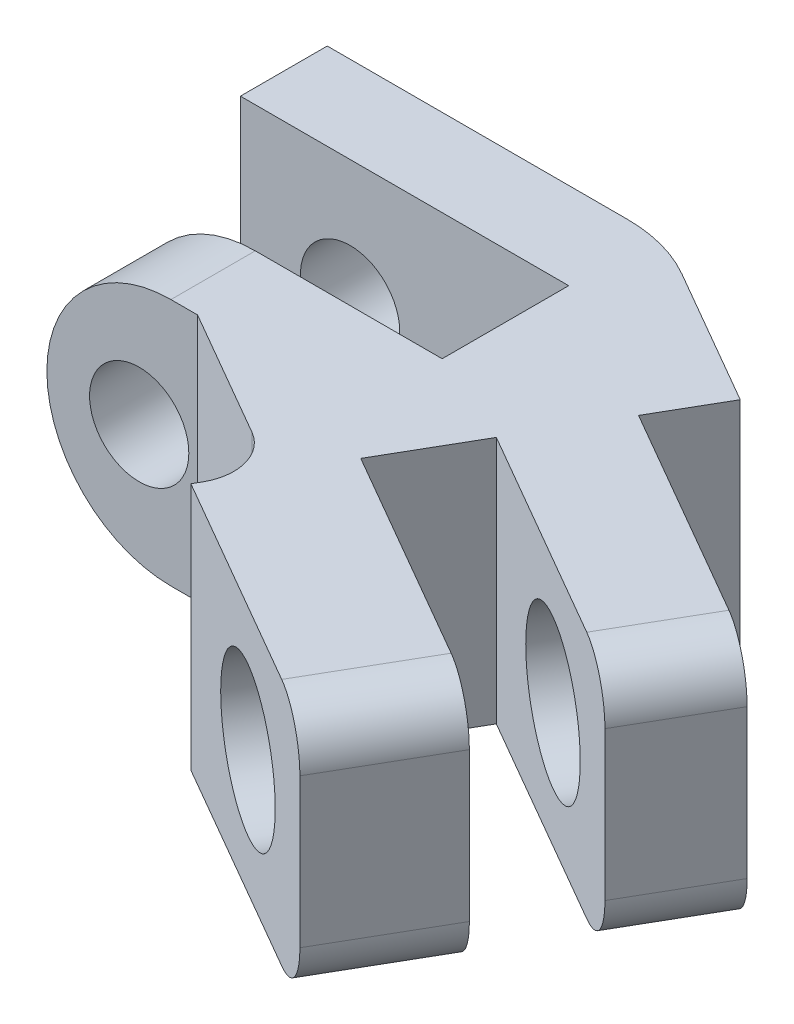
ISO-10303-21;
HEADER;
FILE_DESCRIPTION(('STEP AP214'),'2;1');
FILE_NAME('part.step','',(''),(''),'','','');
FILE_SCHEMA(('AUTOMOTIVE_DESIGN { 1 0 10303 214 1 1 1 1 }'));
ENDSEC;
DATA;
#1=APPLICATION_CONTEXT('core data for automotive mechanical design processes');
#2=APPLICATION_PROTOCOL_DEFINITION('international standard','automotive_design',2000,#1);
#3=PRODUCT_CONTEXT('',#1,'mechanical');
#4=PRODUCT('Part','Part','',(#3));
#5=PRODUCT_RELATED_PRODUCT_CATEGORY('part','',(#4));
#6=PRODUCT_DEFINITION_FORMATION('','',#4);
#7=PRODUCT_DEFINITION_CONTEXT('part definition',#1,'design');
#8=PRODUCT_DEFINITION('design','',#6,#7);
#9=PRODUCT_DEFINITION_SHAPE('','',#8);
#10=(LENGTH_UNIT() NAMED_UNIT(*) SI_UNIT(.MILLI.,.METRE.));
#11=(NAMED_UNIT(*) PLANE_ANGLE_UNIT() SI_UNIT($,.RADIAN.));
#12=(NAMED_UNIT(*) SI_UNIT($,.STERADIAN.) SOLID_ANGLE_UNIT());
#13=UNCERTAINTY_MEASURE_WITH_UNIT(LENGTH_MEASURE(1.E-05),#10,'distance_accuracy_value','');
#14=(GEOMETRIC_REPRESENTATION_CONTEXT(3) GLOBAL_UNCERTAINTY_ASSIGNED_CONTEXT((#13)) GLOBAL_UNIT_ASSIGNED_CONTEXT((#10,
#11,#12)) REPRESENTATION_CONTEXT('',''));
#15=CARTESIAN_POINT('',(0.,0.,0.));
#16=DIRECTION('',(0.,0.,1.));
#17=DIRECTION('',(1.,0.,0.));
#18=AXIS2_PLACEMENT_3D('',#15,#16,#17);
#19=CARTESIAN_POINT('',(7.86121593216771,-2.5,13.3121778264911));
#20=DIRECTION('',(-0.866025403784438,0.,-0.500000000000001));
#21=DIRECTION('',(-0.500000000000001,0.,0.866025403784438));
#22=AXIS2_PLACEMENT_3D('',#19,#20,#21);
#23=PLANE('',#22);
#24=DIRECTION('',(0.,-1.,0.));
#25=VECTOR('',#24,1.);
#26=CARTESIAN_POINT('',(11.9102540378444,1.5,6.29903810567667));
#27=LINE('',#26,#25);
#28=CARTESIAN_POINT('',(11.9102540378444,1.5,6.29903810567667));
#29=VERTEX_POINT('',#28);
#30=CARTESIAN_POINT('',(11.9102540378444,-1.5,6.29903810567667));
#31=VERTEX_POINT('',#30);
#32=EDGE_CURVE('E49',#29,#31,#27,.T.);
#33=ORIENTED_EDGE('',*,*,#32,.F.);
#34=DIRECTION('',(0.500000000000001,0.,-0.866025403784438));
#35=VECTOR('',#34,1.);
#36=CARTESIAN_POINT('',(10.8612159321677,1.5,8.11602540378445));
#37=LINE('',#36,#35);
#38=CARTESIAN_POINT('',(10.8612159321677,1.5,8.11602540378445));
#39=VERTEX_POINT('',#38);
#40=EDGE_CURVE('E232',#29,#39,#37,.F.);
#41=ORIENTED_EDGE('',*,*,#40,.T.);
#42=DIRECTION('',(0.,1.,0.));
#43=VECTOR('',#42,1.);
#44=CARTESIAN_POINT('',(10.8612159321677,-2.5,8.11602540378445));
#45=LINE('',#44,#43);
#46=CARTESIAN_POINT('',(10.8612159321677,-1.5,8.11602540378445));
#47=VERTEX_POINT('',#46);
#48=EDGE_CURVE('E243',#47,#39,#45,.T.);
#49=ORIENTED_EDGE('',*,*,#48,.F.);
#50=DIRECTION('',(0.500000000000001,0.,-0.866025403784438));
#51=VECTOR('',#50,1.);
#52=CARTESIAN_POINT('',(12.6602540378444,-1.5,5.00000000000001));
#53=LINE('',#52,#51);
#54=EDGE_CURVE('E230',#47,#31,#53,.T.);
#55=ORIENTED_EDGE('',*,*,#54,.T.);
#56=EDGE_LOOP('',(#33,#41,#49,#55));
#57=FACE_BOUND('',#56,.T.);
#58=ADVANCED_FACE('F34',(#57),#23,.F.);
#59=CARTESIAN_POINT('',(2.79544915328567,0.,16.3695068206205));
#60=DIRECTION('',(0.500000000000001,0.,-0.866025403784438));
#61=DIRECTION('',(-0.866025403784438,0.,-0.500000000000001));
#62=AXIS2_PLACEMENT_3D('',#59,#60,#61);
#63=CYLINDRICAL_SURFACE('',#62,1.5);
#64=CARTESIAN_POINT('',(8.38575313632761,0.,6.68681629223726));
#65=DIRECTION('',(-0.500000000000001,0.,0.866025403784438));
#66=DIRECTION('',(0.866025403784438,0.,0.500000000000001));
#67=AXIS2_PLACEMENT_3D('',#64,#65,#66);
#68=CIRCLE('',#67,1.5);
#69=CARTESIAN_POINT('',(9.68479124200427,0.,7.43681629223726));
#70=VERTEX_POINT('',#69);
#71=EDGE_CURVE('E294',#70,#70,#68,.T.);
#72=ORIENTED_EDGE('',*,*,#71,.T.);
#73=EDGE_LOOP('',(#72));
#74=FACE_BOUND('',#73,.T.);
#75=CARTESIAN_POINT('',(9.43479124200427,0.,4.86982899412947));
#76=DIRECTION('',(0.500000000000001,0.,-0.866025403784438));
#77=DIRECTION('',(-0.866025403784438,0.,-0.500000000000001));
#78=AXIS2_PLACEMENT_3D('',#75,#76,#77);
#79=CIRCLE('',#78,1.5);
#80=CARTESIAN_POINT('',(8.13575313632762,0.,4.11982899412947));
#81=VERTEX_POINT('',#80);
#82=EDGE_CURVE('E268',#81,#81,#79,.F.);
#83=ORIENTED_EDGE('',*,*,#82,.F.);
#84=EDGE_LOOP('',(#83));
#85=FACE_BOUND('',#84,.T.);
#86=ADVANCED_FACE('F450',(#74,#85),#63,.F.);
#87=CARTESIAN_POINT('',(5.42351829610426,1.5,15.5343939856435));
#88=DIRECTION('',(-0.500000000000001,0.,0.866025403784438));
#89=DIRECTION('',(0.866025403784438,0.,0.500000000000001));
#90=AXIS2_PLACEMENT_3D('',#87,#88,#89);
#91=CYLINDRICAL_SURFACE('',#90,1.);
#92=ORIENTED_EDGE('',*,*,#40,.F.);
#93=CARTESIAN_POINT('',(11.0442286340599,1.5,5.79903810567667));
#94=DIRECTION('',(0.500000000000001,0.,-0.866025403784438));
#95=DIRECTION('',(-0.866025403784438,0.,-0.500000000000001));
#96=AXIS2_PLACEMENT_3D('',#93,#94,#95);
#97=CIRCLE('',#96,1.);
#98=CARTESIAN_POINT('',(11.0442286340599,2.5,5.79903810567667));
#99=VERTEX_POINT('',#98);
#100=EDGE_CURVE('E258',#99,#29,#97,.T.);
#101=ORIENTED_EDGE('',*,*,#100,.F.);
#102=DIRECTION('',(0.500000000000001,0.,-0.866025403784438));
#103=VECTOR('',#102,1.);
#104=CARTESIAN_POINT('',(11.7942286340599,2.5,4.50000000000001));
#105=LINE('',#104,#103);
#106=CARTESIAN_POINT('',(9.99519052838328,2.5,7.61602540378445));
#107=VERTEX_POINT('',#106);
#108=EDGE_CURVE('E220',#107,#99,#105,.T.);
#109=ORIENTED_EDGE('',*,*,#108,.F.);
#110=CARTESIAN_POINT('',(9.99519052838328,1.5,7.61602540378445));
#111=DIRECTION('',(-0.500000000000001,0.,0.866025403784438));
#112=DIRECTION('',(0.866025403784438,0.,0.500000000000001));
#113=AXIS2_PLACEMENT_3D('',#110,#111,#112);
#114=CIRCLE('',#113,1.);
#115=EDGE_CURVE('E42',#39,#107,#114,.T.);
#116=ORIENTED_EDGE('',*,*,#115,.F.);
#117=EDGE_LOOP('',(#92,#101,#109,#116));
#118=FACE_BOUND('',#117,.T.);
#119=ADVANCED_FACE('F257',(#118),#91,.T.);
#120=CARTESIAN_POINT('',(6.99519052838327,-1.5,12.8121778264911));
#121=DIRECTION('',(-0.500000000000001,0.,0.866025403784438));
#122=DIRECTION('',(0.866025403784438,0.,0.500000000000001));
#123=AXIS2_PLACEMENT_3D('',#120,#121,#122);
#124=CYLINDRICAL_SURFACE('',#123,1.);
#125=DIRECTION('',(0.500000000000001,0.,-0.866025403784438));
#126=VECTOR('',#125,1.);
#127=CARTESIAN_POINT('',(9.99519052838328,-2.5,7.61602540378444));
#128=LINE('',#127,#126);
#129=CARTESIAN_POINT('',(11.0442286340599,-2.5,5.79903810567667));
#130=VERTEX_POINT('',#129);
#131=CARTESIAN_POINT('',(9.99519052838328,-2.5,7.61602540378445));
#132=VERTEX_POINT('',#131);
#133=EDGE_CURVE('E208',#130,#132,#128,.F.);
#134=ORIENTED_EDGE('',*,*,#133,.F.);
#135=CARTESIAN_POINT('',(11.0442286340599,-1.5,5.79903810567667));
#136=DIRECTION('',(0.500000000000001,0.,-0.866025403784438));
#137=DIRECTION('',(-0.866025403784438,0.,-0.500000000000001));
#138=AXIS2_PLACEMENT_3D('',#135,#136,#137);
#139=CIRCLE('',#138,0.999999999999999);
#140=EDGE_CURVE('E192',#31,#130,#139,.T.);
#141=ORIENTED_EDGE('',*,*,#140,.F.);
#142=ORIENTED_EDGE('',*,*,#54,.F.);
#143=CARTESIAN_POINT('',(9.99519052838328,-1.5,7.61602540378445));
#144=DIRECTION('',(-0.500000000000001,0.,0.866025403784438));
#145=DIRECTION('',(0.866025403784438,0.,0.500000000000001));
#146=AXIS2_PLACEMENT_3D('',#143,#144,#145);
#147=CIRCLE('',#146,1.);
#148=EDGE_CURVE('E215',#132,#47,#147,.T.);
#149=ORIENTED_EDGE('',*,*,#148,.F.);
#150=EDGE_LOOP('',(#134,#141,#142,#149));
#151=FACE_BOUND('',#150,.T.);
#152=ADVANCED_FACE('F36',(#151),#124,.T.);
#153=CARTESIAN_POINT('',(-0.639695783803518,0.,0.));
#154=DIRECTION('',(0.,0.,1.));
#155=DIRECTION('',(1.,0.,0.));
#156=AXIS2_PLACEMENT_3D('',#153,#154,#155);
#157=CYLINDRICAL_SURFACE('',#156,1.);
#158=CARTESIAN_POINT('',(-0.639695783803518,0.,0.));
#159=DIRECTION('',(0.,0.,1.));
#160=DIRECTION('',(1.,0.,0.));
#161=AXIS2_PLACEMENT_3D('',#158,#159,#160);
#162=CIRCLE('',#161,1.);
#163=CARTESIAN_POINT('',(0.360304216196482,0.,0.));
#164=VERTEX_POINT('',#163);
#165=EDGE_CURVE('E334',#164,#164,#162,.T.);
#166=ORIENTED_EDGE('',*,*,#165,.F.);
#167=EDGE_LOOP('',(#166));
#168=FACE_BOUND('',#167,.T.);
#169=CARTESIAN_POINT('',(-0.639695783803518,0.,1.75));
#170=DIRECTION('',(0.,0.,1.));
#171=DIRECTION('',(1.,0.,0.));
#172=AXIS2_PLACEMENT_3D('',#169,#170,#171);
#173=CIRCLE('',#172,1.);
#174=CARTESIAN_POINT('',(0.360304216196482,0.,1.75));
#175=VERTEX_POINT('',#174);
#176=EDGE_CURVE('E333',#175,#175,#173,.F.);
#177=ORIENTED_EDGE('',*,*,#176,.F.);
#178=EDGE_LOOP('',(#177));
#179=FACE_BOUND('',#178,.T.);
#180=ADVANCED_FACE('F480',(#168,#179),#157,.F.);
#181=CARTESIAN_POINT('',(0.,0.,6.));
#182=DIRECTION('',(0.,0.,1.));
#183=DIRECTION('',(1.,0.,0.));
#184=AXIS2_PLACEMENT_3D('',#181,#182,#183);
#185=PLANE('',#184);
#186=CARTESIAN_POINT('',(-0.639695783803518,0.,6.));
#187=DIRECTION('',(0.,0.,1.));
#188=DIRECTION('',(1.,0.,0.));
#189=AXIS2_PLACEMENT_3D('',#186,#187,#188);
#190=CIRCLE('',#189,1.);
#191=CARTESIAN_POINT('',(0.360304216196482,0.,6.));
#192=VERTEX_POINT('',#191);
#193=EDGE_CURVE('E338',#192,#192,#190,.T.);
#194=ORIENTED_EDGE('',*,*,#193,.F.);
#195=EDGE_LOOP('',(#194));
#196=FACE_BOUND('',#195,.T.);
#197=DIRECTION('',(-1.,0.,0.));
#198=VECTOR('',#197,1.);
#199=CARTESIAN_POINT('',(0.,-2.5,6.));
#200=LINE('',#199,#198);
#201=CARTESIAN_POINT('',(0.535898384862239,-2.5,6.));
#202=VERTEX_POINT('',#201);
#203=CARTESIAN_POINT('',(0.,-2.5,6.));
#204=VERTEX_POINT('',#203);
#205=EDGE_CURVE('E374',#202,#204,#200,.T.);
#206=ORIENTED_EDGE('',*,*,#205,.F.);
#207=DIRECTION('',(0.,1.,0.));
#208=VECTOR('',#207,1.);
#209=CARTESIAN_POINT('',(0.535898384862235,0.,6.));
#210=LINE('',#209,#208);
#211=CARTESIAN_POINT('',(0.535898384862239,2.5,6.));
#212=VERTEX_POINT('',#211);
#213=EDGE_CURVE('E363',#202,#212,#210,.T.);
#214=ORIENTED_EDGE('',*,*,#213,.T.);
#215=DIRECTION('',(1.,0.,0.));
#216=VECTOR('',#215,1.);
#217=CARTESIAN_POINT('',(0.,2.5,6.));
#218=LINE('',#217,#216);
#219=CARTESIAN_POINT('',(0.,2.5,6.));
#220=VERTEX_POINT('',#219);
#221=EDGE_CURVE('E369',#220,#212,#218,.T.);
#222=ORIENTED_EDGE('',*,*,#221,.F.);
#223=CARTESIAN_POINT('',(0.,0.,6.));
#224=DIRECTION('',(0.,0.,1.));
#225=DIRECTION('',(1.,0.,0.));
#226=AXIS2_PLACEMENT_3D('',#223,#224,#225);
#227=CIRCLE('',#226,2.5);
#228=EDGE_CURVE('E382',#220,#204,#227,.T.);
#229=ORIENTED_EDGE('',*,*,#228,.T.);
#230=EDGE_LOOP('',(#206,#214,#222,#229));
#231=FACE_BOUND('',#230,.T.);
#232=ADVANCED_FACE('F476',(#196,#231),#185,.T.);
#233=CARTESIAN_POINT('',(0.,0.,6.));
#234=DIRECTION('',(0.,0.,-1.));
#235=DIRECTION('',(-1.,0.,0.));
#236=AXIS2_PLACEMENT_3D('',#233,#234,#235);
#237=CYLINDRICAL_SURFACE('',#236,2.5);
#238=DIRECTION('',(0.,0.,-1.));
#239=VECTOR('',#238,1.);
#240=CARTESIAN_POINT('',(0.,2.5,12.4031242374328));
#241=LINE('',#240,#239);
#242=CARTESIAN_POINT('',(0.,2.5,4.3));
#243=VERTEX_POINT('',#242);
#244=EDGE_CURVE('E379',#220,#243,#241,.T.);
#245=ORIENTED_EDGE('',*,*,#244,.T.);
#246=CARTESIAN_POINT('',(0.,0.,4.3));
#247=DIRECTION('',(0.,0.,1.));
#248=DIRECTION('',(1.,0.,0.));
#249=AXIS2_PLACEMENT_3D('',#246,#247,#248);
#250=CIRCLE('',#249,2.5);
#251=CARTESIAN_POINT('',(0.,-2.5,4.3));
#252=VERTEX_POINT('',#251);
#253=EDGE_CURVE('E317',#243,#252,#250,.T.);
#254=ORIENTED_EDGE('',*,*,#253,.T.);
#255=DIRECTION('',(0.,0.,-1.));
#256=VECTOR('',#255,1.);
#257=CARTESIAN_POINT('',(0.,-2.5,12.4031242374328));
#258=LINE('',#257,#256);
#259=EDGE_CURVE('E376',#204,#252,#258,.T.);
#260=ORIENTED_EDGE('',*,*,#259,.F.);
#261=ORIENTED_EDGE('',*,*,#228,.F.);
#262=EDGE_LOOP('',(#245,#254,#260,#261));
#263=FACE_BOUND('',#262,.T.);
#264=ADVANCED_FACE('F479',(#263),#237,.T.);
#265=CARTESIAN_POINT('',(0.,0.,0.));
#266=DIRECTION('',(0.,0.,1.));
#267=DIRECTION('',(1.,0.,0.));
#268=AXIS2_PLACEMENT_3D('',#265,#266,#267);
#269=PLANE('',#268);
#270=ORIENTED_EDGE('',*,*,#165,.T.);
#271=EDGE_LOOP('',(#270));
#272=FACE_BOUND('',#271,.T.);
#273=DIRECTION('',(1.,0.,0.));
#274=VECTOR('',#273,1.);
#275=CARTESIAN_POINT('',(0.,2.5,0.));
#276=LINE('',#275,#274);
#277=CARTESIAN_POINT('',(-2.85,2.5,0.));
#278=VERTEX_POINT('',#277);
#279=CARTESIAN_POINT('',(3.19615242270663,2.5,0.));
#280=VERTEX_POINT('',#279);
#281=EDGE_CURVE('E366',#278,#280,#276,.T.);
#282=ORIENTED_EDGE('',*,*,#281,.T.);
#283=DIRECTION('',(0.,-1.,0.));
#284=VECTOR('',#283,1.);
#285=CARTESIAN_POINT('',(3.19615242270663,0.,0.));
#286=LINE('',#285,#284);
#287=CARTESIAN_POINT('',(3.19615242270663,-2.5,0.));
#288=VERTEX_POINT('',#287);
#289=EDGE_CURVE('E399',#280,#288,#286,.T.);
#290=ORIENTED_EDGE('',*,*,#289,.T.);
#291=DIRECTION('',(-1.,0.,0.));
#292=VECTOR('',#291,1.);
#293=CARTESIAN_POINT('',(0.,-2.5,0.));
#294=LINE('',#293,#292);
#295=CARTESIAN_POINT('',(-2.85,-2.5,0.));
#296=VERTEX_POINT('',#295);
#297=EDGE_CURVE('E367',#288,#296,#294,.T.);
#298=ORIENTED_EDGE('',*,*,#297,.T.);
#299=DIRECTION('',(0.,1.,0.));
#300=VECTOR('',#299,1.);
#301=CARTESIAN_POINT('',(-2.85,2.5,0.));
#302=LINE('',#301,#300);
#303=EDGE_CURVE('E284',#296,#278,#302,.T.);
#304=ORIENTED_EDGE('',*,*,#303,.T.);
#305=EDGE_LOOP('',(#282,#290,#298,#304));
#306=FACE_BOUND('',#305,.T.);
#307=ADVANCED_FACE('F473',(#272,#306),#269,.F.);
#308=CARTESIAN_POINT('',(0.,2.5,12.4031242374328));
#309=DIRECTION('',(0.,1.,0.));
#310=DIRECTION('',(-1.,0.,0.));
#311=AXIS2_PLACEMENT_3D('',#308,#309,#310);
#312=PLANE('',#311);
#313=DIRECTION('',(0.500000000000001,0.,-0.866025403784438));
#314=VECTOR('',#313,1.);
#315=CARTESIAN_POINT('',(6.73346143998121,2.5,3.3102155057615));
#316=LINE('',#315,#314);
#317=CARTESIAN_POINT('',(6.73346143998121,2.5,3.3102155057615));
#318=VERTEX_POINT('',#317);
#319=CARTESIAN_POINT('',(7.48346143998122,2.5,2.01117740008484));
#320=VERTEX_POINT('',#319);
#321=EDGE_CURVE('E266',#318,#320,#316,.T.);
#322=ORIENTED_EDGE('',*,*,#321,.T.);
#323=DIRECTION('',(-0.866025403784438,0.,-0.500000000000001));
#324=VECTOR('',#323,1.);
#325=CARTESIAN_POINT('',(12.6602540378444,2.5,5.00000000000001));
#326=LINE('',#325,#324);
#327=CARTESIAN_POINT('',(4.69615242270663,2.5,0.401923788646684));
#328=VERTEX_POINT('',#327);
#329=EDGE_CURVE('E359',#320,#328,#326,.T.);
#330=ORIENTED_EDGE('',*,*,#329,.T.);
#331=CARTESIAN_POINT('',(3.19615242270663,2.5,3.));
#332=DIRECTION('',(0.,1.,0.));
#333=DIRECTION('',(-1.,0.,0.));
#334=AXIS2_PLACEMENT_3D('',#331,#332,#333);
#335=CIRCLE('',#334,3.);
#336=EDGE_CURVE('E407',#328,#280,#335,.T.);
#337=ORIENTED_EDGE('',*,*,#336,.T.);
#338=ORIENTED_EDGE('',*,*,#281,.F.);
#339=DIRECTION('',(0.,0.,-1.));
#340=VECTOR('',#339,1.);
#341=CARTESIAN_POINT('',(-2.85,2.5,7.50521502639128));
#342=LINE('',#341,#340);
#343=CARTESIAN_POINT('',(-2.85,2.5,1.75));
#344=VERTEX_POINT('',#343);
#345=EDGE_CURVE('E291',#344,#278,#342,.T.);
#346=ORIENTED_EDGE('',*,*,#345,.F.);
#347=DIRECTION('',(-1.,0.,0.));
#348=VECTOR('',#347,1.);
#349=CARTESIAN_POINT('',(3.76569860759446,2.5,1.75));
#350=LINE('',#349,#348);
#351=CARTESIAN_POINT('',(3.76569860759446,2.5,1.75));
#352=VERTEX_POINT('',#351);
#353=EDGE_CURVE('E315',#352,#344,#350,.T.);
#354=ORIENTED_EDGE('',*,*,#353,.F.);
#355=DIRECTION('',(0.,0.,-1.));
#356=VECTOR('',#355,1.);
#357=CARTESIAN_POINT('',(3.76569860759446,2.5,4.3));
#358=LINE('',#357,#356);
#359=CARTESIAN_POINT('',(3.76569860759446,2.5,4.3));
#360=VERTEX_POINT('',#359);
#361=EDGE_CURVE('E328',#360,#352,#358,.T.);
#362=ORIENTED_EDGE('',*,*,#361,.F.);
#363=DIRECTION('',(-1.,0.,0.));
#364=VECTOR('',#363,1.);
#365=CARTESIAN_POINT('',(3.76569860759446,2.5,4.3));
#366=LINE('',#365,#364);
#367=EDGE_CURVE('E325',#360,#243,#366,.T.);
#368=ORIENTED_EDGE('',*,*,#367,.T.);
#369=ORIENTED_EDGE('',*,*,#244,.F.);
#370=ORIENTED_EDGE('',*,*,#221,.T.);
#371=DIRECTION('',(-0.866025403784438,0.,-0.500000000000001));
#372=VECTOR('',#371,1.);
#373=CARTESIAN_POINT('',(3.99999999999999,2.5,8.));
#374=LINE('',#373,#372);
#375=CARTESIAN_POINT('',(3.13397459621555,2.5,7.5));
#376=VERTEX_POINT('',#375);
#377=EDGE_CURVE('E305',#376,#212,#374,.T.);
#378=ORIENTED_EDGE('',*,*,#377,.F.);
#379=CARTESIAN_POINT('',(2.63397459621555,2.5,8.36602540378444));
#380=DIRECTION('',(0.,1.,0.));
#381=DIRECTION('',(-1.,0.,0.));
#382=AXIS2_PLACEMENT_3D('',#379,#380,#381);
#383=CIRCLE('',#382,1.);
#384=CARTESIAN_POINT('',(3.49999999999999,2.5,8.86602540378444));
#385=VERTEX_POINT('',#384);
#386=EDGE_CURVE('E396',#376,#385,#383,.F.);
#387=ORIENTED_EDGE('',*,*,#386,.T.);
#388=DIRECTION('',(0.500000000000001,0.,-0.866025403784438));
#389=VECTOR('',#388,1.);
#390=CARTESIAN_POINT('',(2.66506350946109,2.5,10.3121778264911));
#391=LINE('',#390,#389);
#392=CARTESIAN_POINT('',(3.41506350946108,2.5,9.01313972081442));
#393=VERTEX_POINT('',#392);
#394=EDGE_CURVE('E300',#393,#385,#391,.T.);
#395=ORIENTED_EDGE('',*,*,#394,.F.);
#396=DIRECTION('',(-0.866025403784438,0.,-0.500000000000001));
#397=VECTOR('',#396,1.);
#398=CARTESIAN_POINT('',(8.61121593216771,2.5,12.0131397208144));
#399=LINE('',#398,#397);
#400=CARTESIAN_POINT('',(7.74519052838327,2.5,11.5131397208144));
#401=VERTEX_POINT('',#400);
#402=EDGE_CURVE('E273',#401,#393,#399,.T.);
#403=ORIENTED_EDGE('',*,*,#402,.F.);
#404=DIRECTION('',(0.500000000000001,0.,-0.866025403784438));
#405=VECTOR('',#404,1.);
#406=CARTESIAN_POINT('',(8.99519052838328,2.5,9.34807621135332));
#407=LINE('',#406,#405);
#408=CARTESIAN_POINT('',(8.99519052838328,2.5,9.34807621135332));
#409=VERTEX_POINT('',#408);
#410=EDGE_CURVE('E228',#401,#409,#407,.T.);
#411=ORIENTED_EDGE('',*,*,#410,.T.);
#412=DIRECTION('',(-0.866025403784438,0.,-0.500000000000001));
#413=VECTOR('',#412,1.);
#414=CARTESIAN_POINT('',(9.86121593216772,2.5,9.84807621135332));
#415=LINE('',#414,#413);
#416=CARTESIAN_POINT('',(4.68442333430455,2.5,6.85925361143816));
#417=VERTEX_POINT('',#416);
#418=EDGE_CURVE('E354',#409,#417,#415,.T.);
#419=ORIENTED_EDGE('',*,*,#418,.T.);
#420=DIRECTION('',(0.500000000000001,0.,-0.866025403784438));
#421=VECTOR('',#420,1.);
#422=CARTESIAN_POINT('',(4.68442333430455,2.5,6.85925361143816));
#423=LINE('',#422,#421);
#424=CARTESIAN_POINT('',(5.68442333430455,2.5,5.12720280386928));
#425=VERTEX_POINT('',#424);
#426=EDGE_CURVE('E253',#417,#425,#423,.T.);
#427=ORIENTED_EDGE('',*,*,#426,.T.);
#428=DIRECTION('',(-0.866025403784438,0.,-0.500000000000001));
#429=VECTOR('',#428,1.);
#430=CARTESIAN_POINT('',(10.8612159321677,2.5,8.11602540378445));
#431=LINE('',#430,#429);
#432=EDGE_CURVE('E240',#107,#425,#431,.T.);
#433=ORIENTED_EDGE('',*,*,#432,.F.);
#434=ORIENTED_EDGE('',*,*,#108,.T.);
#435=DIRECTION('',(0.866025403784438,0.,0.500000000000001));
#436=VECTOR('',#435,1.);
#437=CARTESIAN_POINT('',(6.73346143998121,2.5,3.3102155057615));
#438=LINE('',#437,#436);
#439=EDGE_CURVE('E259',#318,#99,#438,.T.);
#440=ORIENTED_EDGE('',*,*,#439,.F.);
#441=EDGE_LOOP('',(#322,#330,#337,#338,#346,#354,#362,#368,#369,#370,#378,#387,#395,#403,#411,
#419,#427,#433,#434,#440));
#442=FACE_BOUND('',#441,.T.);
#443=ADVANCED_FACE('F250',(#442),#312,.T.);
#444=CARTESIAN_POINT('',(0.,-2.5,12.4031242374328));
#445=DIRECTION('',(0.,-1.,0.));
#446=DIRECTION('',(1.,0.,0.));
#447=AXIS2_PLACEMENT_3D('',#444,#445,#446);
#448=PLANE('',#447);
#449=DIRECTION('',(0.500000000000001,0.,-0.866025403784438));
#450=VECTOR('',#449,1.);
#451=CARTESIAN_POINT('',(6.73346143998121,-2.5,3.3102155057615));
#452=LINE('',#451,#450);
#453=CARTESIAN_POINT('',(6.73346143998121,-2.5,3.3102155057615));
#454=VERTEX_POINT('',#453);
#455=CARTESIAN_POINT('',(7.48346143998122,-2.5,2.01117740008484));
#456=VERTEX_POINT('',#455);
#457=EDGE_CURVE('E211',#454,#456,#452,.T.);
#458=ORIENTED_EDGE('',*,*,#457,.F.);
#459=DIRECTION('',(-0.866025403784438,0.,-0.500000000000001));
#460=VECTOR('',#459,1.);
#461=CARTESIAN_POINT('',(11.0442286340599,-2.5,5.79903810567667));
#462=LINE('',#461,#460);
#463=EDGE_CURVE('E197',#130,#454,#462,.T.);
#464=ORIENTED_EDGE('',*,*,#463,.F.);
#465=ORIENTED_EDGE('',*,*,#133,.T.);
#466=DIRECTION('',(0.866025403784438,0.,0.500000000000001));
#467=VECTOR('',#466,1.);
#468=CARTESIAN_POINT('',(5.68442333430455,-2.5,5.12720280386928));
#469=LINE('',#468,#467);
#470=CARTESIAN_POINT('',(5.68442333430455,-2.5,5.12720280386928));
#471=VERTEX_POINT('',#470);
#472=EDGE_CURVE('E343',#471,#132,#469,.T.);
#473=ORIENTED_EDGE('',*,*,#472,.F.);
#474=DIRECTION('',(0.500000000000001,0.,-0.866025403784438));
#475=VECTOR('',#474,1.);
#476=CARTESIAN_POINT('',(4.68442333430455,-2.5,6.85925361143816));
#477=LINE('',#476,#475);
#478=CARTESIAN_POINT('',(4.68442333430455,-2.5,6.85925361143816));
#479=VERTEX_POINT('',#478);
#480=EDGE_CURVE('E357',#479,#471,#477,.T.);
#481=ORIENTED_EDGE('',*,*,#480,.F.);
#482=DIRECTION('',(0.866025403784438,0.,0.500000000000001));
#483=VECTOR('',#482,1.);
#484=CARTESIAN_POINT('',(4.68442333430455,-2.5,6.85925361143816));
#485=LINE('',#484,#483);
#486=CARTESIAN_POINT('',(8.99519052838328,-2.5,9.34807621135332));
#487=VERTEX_POINT('',#486);
#488=EDGE_CURVE('E348',#479,#487,#485,.T.);
#489=ORIENTED_EDGE('',*,*,#488,.T.);
#490=DIRECTION('',(0.500000000000001,0.,-0.866025403784438));
#491=VECTOR('',#490,1.);
#492=CARTESIAN_POINT('',(6.99519052838327,-2.5,12.8121778264911));
#493=LINE('',#492,#491);
#494=CARTESIAN_POINT('',(7.74519052838327,-2.5,11.5131397208144));
#495=VERTEX_POINT('',#494);
#496=EDGE_CURVE('E216',#487,#495,#493,.F.);
#497=ORIENTED_EDGE('',*,*,#496,.T.);
#498=DIRECTION('',(0.866025403784438,0.,0.500000000000001));
#499=VECTOR('',#498,1.);
#500=CARTESIAN_POINT('',(2.32167223227901,-2.5,8.38186997260376));
#501=LINE('',#500,#499);
#502=CARTESIAN_POINT('',(3.41506350946108,-2.5,9.01313972081442));
#503=VERTEX_POINT('',#502);
#504=EDGE_CURVE('E277',#503,#495,#501,.T.);
#505=ORIENTED_EDGE('',*,*,#504,.F.);
#506=DIRECTION('',(-0.500000000000001,0.,0.866025403784438));
#507=VECTOR('',#506,1.);
#508=CARTESIAN_POINT('',(3.99999999999999,-2.5,8.));
#509=LINE('',#508,#507);
#510=CARTESIAN_POINT('',(3.49999999999999,-2.5,8.86602540378444));
#511=VERTEX_POINT('',#510);
#512=EDGE_CURVE('E302',#511,#503,#509,.T.);
#513=ORIENTED_EDGE('',*,*,#512,.F.);
#514=CARTESIAN_POINT('',(2.63397459621555,-2.5,8.36602540378444));
#515=DIRECTION('',(0.,-1.,0.));
#516=DIRECTION('',(1.,0.,0.));
#517=AXIS2_PLACEMENT_3D('',#514,#515,#516);
#518=CIRCLE('',#517,1.);
#519=CARTESIAN_POINT('',(3.13397459621555,-2.5,7.5));
#520=VERTEX_POINT('',#519);
#521=EDGE_CURVE('E394',#511,#520,#518,.F.);
#522=ORIENTED_EDGE('',*,*,#521,.T.);
#523=DIRECTION('',(-0.866025403784438,0.,-0.500000000000001));
#524=VECTOR('',#523,1.);
#525=CARTESIAN_POINT('',(3.99999999999999,-2.5,8.));
#526=LINE('',#525,#524);
#527=EDGE_CURVE('E306',#520,#202,#526,.T.);
#528=ORIENTED_EDGE('',*,*,#527,.T.);
#529=ORIENTED_EDGE('',*,*,#205,.T.);
#530=ORIENTED_EDGE('',*,*,#259,.T.);
#531=DIRECTION('',(1.,0.,0.));
#532=VECTOR('',#531,1.);
#533=CARTESIAN_POINT('',(0.,-2.5,4.3));
#534=LINE('',#533,#532);
#535=CARTESIAN_POINT('',(3.76569860759446,-2.5,4.3));
#536=VERTEX_POINT('',#535);
#537=EDGE_CURVE('E320',#252,#536,#534,.T.);
#538=ORIENTED_EDGE('',*,*,#537,.T.);
#539=DIRECTION('',(0.,0.,-1.));
#540=VECTOR('',#539,1.);
#541=CARTESIAN_POINT('',(3.76569860759446,-2.5,4.3));
#542=LINE('',#541,#540);
#543=CARTESIAN_POINT('',(3.76569860759446,-2.5,1.75));
#544=VERTEX_POINT('',#543);
#545=EDGE_CURVE('E330',#536,#544,#542,.T.);
#546=ORIENTED_EDGE('',*,*,#545,.T.);
#547=DIRECTION('',(1.,0.,0.));
#548=VECTOR('',#547,1.);
#549=CARTESIAN_POINT('',(0.,-2.5,1.75));
#550=LINE('',#549,#548);
#551=CARTESIAN_POINT('',(-2.85,-2.5,1.75));
#552=VERTEX_POINT('',#551);
#553=EDGE_CURVE('E308',#552,#544,#550,.T.);
#554=ORIENTED_EDGE('',*,*,#553,.F.);
#555=DIRECTION('',(0.,0.,-1.));
#556=VECTOR('',#555,1.);
#557=CARTESIAN_POINT('',(-2.85,-2.5,7.50521502639128));
#558=LINE('',#557,#556);
#559=EDGE_CURVE('E287',#552,#296,#558,.T.);
#560=ORIENTED_EDGE('',*,*,#559,.T.);
#561=ORIENTED_EDGE('',*,*,#297,.F.);
#562=CARTESIAN_POINT('',(3.19615242270663,-2.5,3.));
#563=DIRECTION('',(0.,-1.,0.));
#564=DIRECTION('',(1.,0.,0.));
#565=AXIS2_PLACEMENT_3D('',#562,#563,#564);
#566=CIRCLE('',#565,3.);
#567=CARTESIAN_POINT('',(4.69615242270663,-2.5,0.401923788646685));
#568=VERTEX_POINT('',#567);
#569=EDGE_CURVE('E402',#288,#568,#566,.T.);
#570=ORIENTED_EDGE('',*,*,#569,.T.);
#571=DIRECTION('',(0.866025403784438,0.,0.500000000000001));
#572=VECTOR('',#571,1.);
#573=CARTESIAN_POINT('',(4.,-2.5,0.));
#574=LINE('',#573,#572);
#575=EDGE_CURVE('E361',#568,#456,#574,.T.);
#576=ORIENTED_EDGE('',*,*,#575,.T.);
#577=EDGE_LOOP('',(#458,#464,#465,#473,#481,#489,#497,#505,#513,#522,#528,#529,#530,#538,#546,
#554,#560,#561,#570,#576));
#578=FACE_BOUND('',#577,.T.);
#579=ADVANCED_FACE('F206',(#578),#448,.T.);
#580=DIRECTION('',(0.500000000000001,0.,-0.866025403784438));
#581=VECTOR('',#580,1.);
#582=CARTESIAN_POINT('',(7.86121593216771,1.5,13.3121778264911));
#583=LINE('',#582,#581);
#584=CARTESIAN_POINT('',(9.86121593216772,1.5,9.84807621135332));
#585=VERTEX_POINT('',#584);
#586=CARTESIAN_POINT('',(8.61121593216771,1.5,12.0131397208144));
#587=VERTEX_POINT('',#586);
#588=EDGE_CURVE('E409',#585,#587,#583,.F.);
#589=ORIENTED_EDGE('',*,*,#588,.T.);
#590=DIRECTION('',(0.,1.,0.));
#591=VECTOR('',#590,1.);
#592=CARTESIAN_POINT('',(8.61121593216771,2.5,12.0131397208144));
#593=LINE('',#592,#591);
#594=CARTESIAN_POINT('',(8.61121593216771,-1.5,12.0131397208144));
#595=VERTEX_POINT('',#594);
#596=EDGE_CURVE('E56',#595,#587,#593,.T.);
#597=ORIENTED_EDGE('',*,*,#596,.F.);
#598=DIRECTION('',(0.500000000000001,0.,-0.866025403784438));
#599=VECTOR('',#598,1.);
#600=CARTESIAN_POINT('',(9.86121593216772,-1.5,9.84807621135332));
#601=LINE('',#600,#599);
#602=CARTESIAN_POINT('',(9.86121593216772,-1.5,9.84807621135332));
#603=VERTEX_POINT('',#602);
#604=EDGE_CURVE('E414',#595,#603,#601,.T.);
#605=ORIENTED_EDGE('',*,*,#604,.T.);
#606=DIRECTION('',(0.,1.,0.));
#607=VECTOR('',#606,1.);
#608=CARTESIAN_POINT('',(9.86121593216772,-2.5,9.84807621135332));
#609=LINE('',#608,#607);
#610=EDGE_CURVE('E351',#603,#585,#609,.T.);
#611=ORIENTED_EDGE('',*,*,#610,.T.);
#612=EDGE_LOOP('',(#589,#597,#605,#611));
#613=FACE_BOUND('',#612,.T.);
#614=ADVANCED_FACE('F425',(#613),#23,.F.);
#615=CARTESIAN_POINT('',(1.,0.,-1.73205080756888));
#616=DIRECTION('',(-0.500000000000001,0.,0.866025403784438));
#617=DIRECTION('',(0.866025403784438,0.,0.500000000000001));
#618=AXIS2_PLACEMENT_3D('',#615,#616,#617);
#619=PLANE('',#618);
#620=ORIENTED_EDGE('',*,*,#329,.F.);
#621=DIRECTION('',(0.,1.,0.));
#622=VECTOR('',#621,1.);
#623=CARTESIAN_POINT('',(7.48346143998122,-2.5,2.01117740008484));
#624=LINE('',#623,#622);
#625=EDGE_CURVE('E203',#456,#320,#624,.T.);
#626=ORIENTED_EDGE('',*,*,#625,.F.);
#627=ORIENTED_EDGE('',*,*,#575,.F.);
#628=DIRECTION('',(0.,-1.,0.));
#629=VECTOR('',#628,1.);
#630=CARTESIAN_POINT('',(4.69615242270663,0.,0.401923788646686));
#631=LINE('',#630,#629);
#632=EDGE_CURVE('E404',#568,#328,#631,.F.);
#633=ORIENTED_EDGE('',*,*,#632,.T.);
#634=EDGE_LOOP('',(#620,#626,#627,#633));
#635=FACE_BOUND('',#634,.T.);
#636=ADVANCED_FACE('F462',(#635),#619,.F.);
#637=CARTESIAN_POINT('',(4.68442333430455,2.5,6.85925361143816));
#638=DIRECTION('',(0.866025403784438,0.,0.500000000000001));
#639=DIRECTION('',(0.500000000000001,0.,-0.866025403784438));
#640=AXIS2_PLACEMENT_3D('',#637,#638,#639);
#641=PLANE('',#640);
#642=ORIENTED_EDGE('',*,*,#426,.F.);
#643=DIRECTION('',(0.,-1.,0.));
#644=VECTOR('',#643,1.);
#645=CARTESIAN_POINT('',(4.68442333430455,2.5,6.85925361143816));
#646=LINE('',#645,#644);
#647=EDGE_CURVE('E254',#417,#479,#646,.T.);
#648=ORIENTED_EDGE('',*,*,#647,.T.);
#649=ORIENTED_EDGE('',*,*,#480,.T.);
#650=DIRECTION('',(0.,-1.,0.));
#651=VECTOR('',#650,1.);
#652=CARTESIAN_POINT('',(5.68442333430455,2.5,5.12720280386928));
#653=LINE('',#652,#651);
#654=EDGE_CURVE('E337',#425,#471,#653,.T.);
#655=ORIENTED_EDGE('',*,*,#654,.F.);
#656=EDGE_LOOP('',(#642,#648,#649,#655));
#657=FACE_BOUND('',#656,.T.);
#658=ADVANCED_FACE('F447',(#657),#641,.T.);
#659=CARTESIAN_POINT('',(-1.79903810567666,0.,3.11602540378444));
#660=DIRECTION('',(-0.500000000000001,0.,0.866025403784438));
#661=DIRECTION('',(0.866025403784438,0.,0.500000000000001));
#662=AXIS2_PLACEMENT_3D('',#659,#660,#661);
#663=PLANE('',#662);
#664=CARTESIAN_POINT('',(7.38575313632761,0.,8.41886709980613));
#665=DIRECTION('',(-0.500000000000001,0.,0.866025403784438));
#666=DIRECTION('',(0.866025403784438,0.,0.500000000000001));
#667=AXIS2_PLACEMENT_3D('',#664,#665,#666);
#668=CIRCLE('',#667,1.5);
#669=CARTESIAN_POINT('',(8.68479124200427,0.,9.16886709980613));
#670=VERTEX_POINT('',#669);
#671=EDGE_CURVE('E297',#670,#670,#668,.T.);
#672=ORIENTED_EDGE('',*,*,#671,.T.);
#673=EDGE_LOOP('',(#672));
#674=FACE_BOUND('',#673,.T.);
#675=ORIENTED_EDGE('',*,*,#610,.F.);
#676=CARTESIAN_POINT('',(8.99519052838328,-1.5,9.34807621135332));
#677=DIRECTION('',(-0.500000000000001,0.,0.866025403784438));
#678=DIRECTION('',(0.866025403784438,0.,0.500000000000001));
#679=AXIS2_PLACEMENT_3D('',#676,#677,#678);
#680=CIRCLE('',#679,1.);
#681=EDGE_CURVE('E217',#603,#487,#680,.F.);
#682=ORIENTED_EDGE('',*,*,#681,.T.);
#683=ORIENTED_EDGE('',*,*,#488,.F.);
#684=ORIENTED_EDGE('',*,*,#647,.F.);
#685=ORIENTED_EDGE('',*,*,#418,.F.);
#686=CARTESIAN_POINT('',(8.99519052838328,1.5,9.34807621135332));
#687=DIRECTION('',(-0.500000000000001,0.,0.866025403784438));
#688=DIRECTION('',(0.866025403784438,0.,0.500000000000001));
#689=AXIS2_PLACEMENT_3D('',#686,#687,#688);
#690=CIRCLE('',#689,1.);
#691=EDGE_CURVE('E222',#409,#585,#690,.F.);
#692=ORIENTED_EDGE('',*,*,#691,.T.);
#693=EDGE_LOOP('',(#675,#682,#683,#684,#685,#692));
#694=FACE_BOUND('',#693,.T.);
#695=ADVANCED_FACE('F419',(#674,#694),#663,.F.);
#696=CARTESIAN_POINT('',(-0.799038105676659,0.,1.38397459621556));
#697=DIRECTION('',(-0.500000000000001,0.,0.866025403784438));
#698=DIRECTION('',(0.866025403784438,0.,0.500000000000001));
#699=AXIS2_PLACEMENT_3D('',#696,#697,#698);
#700=PLANE('',#699);
#701=ORIENTED_EDGE('',*,*,#71,.F.);
#702=EDGE_LOOP('',(#701));
#703=FACE_BOUND('',#702,.T.);
#704=ORIENTED_EDGE('',*,*,#48,.T.);
#705=ORIENTED_EDGE('',*,*,#115,.T.);
#706=ORIENTED_EDGE('',*,*,#432,.T.);
#707=ORIENTED_EDGE('',*,*,#654,.T.);
#708=ORIENTED_EDGE('',*,*,#472,.T.);
#709=ORIENTED_EDGE('',*,*,#148,.T.);
#710=EDGE_LOOP('',(#704,#705,#706,#707,#708,#709));
#711=FACE_BOUND('',#710,.T.);
#712=ADVANCED_FACE('F238',(#703,#711),#700,.T.);
#713=CARTESIAN_POINT('',(-0.639695783803518,0.,4.3));
#714=DIRECTION('',(0.,0.,1.));
#715=DIRECTION('',(1.,0.,0.));
#716=AXIS2_PLACEMENT_3D('',#713,#714,#715);
#717=CIRCLE('',#716,1.);
#718=CARTESIAN_POINT('',(0.360304216196482,0.,4.3));
#719=VERTEX_POINT('',#718);
#720=EDGE_CURVE('E341',#719,#719,#717,.F.);
#721=ORIENTED_EDGE('',*,*,#720,.T.);
#722=EDGE_LOOP('',(#721));
#723=FACE_BOUND('',#722,.T.);
#724=ORIENTED_EDGE('',*,*,#193,.T.);
#725=EDGE_LOOP('',(#724));
#726=FACE_BOUND('',#725,.T.);
#727=ADVANCED_FACE('F509',(#723,#726),#157,.F.);
#728=CARTESIAN_POINT('',(0.,0.,4.3));
#729=DIRECTION('',(0.,0.,1.));
#730=DIRECTION('',(1.,0.,0.));
#731=AXIS2_PLACEMENT_3D('',#728,#729,#730);
#732=PLANE('',#731);
#733=ORIENTED_EDGE('',*,*,#253,.F.);
#734=ORIENTED_EDGE('',*,*,#367,.F.);
#735=DIRECTION('',(0.,1.,0.));
#736=VECTOR('',#735,1.);
#737=CARTESIAN_POINT('',(3.76569860759446,-2.5,4.3));
#738=LINE('',#737,#736);
#739=EDGE_CURVE('E323',#536,#360,#738,.T.);
#740=ORIENTED_EDGE('',*,*,#739,.F.);
#741=ORIENTED_EDGE('',*,*,#537,.F.);
#742=EDGE_LOOP('',(#733,#734,#740,#741));
#743=FACE_BOUND('',#742,.T.);
#744=ORIENTED_EDGE('',*,*,#720,.F.);
#745=EDGE_LOOP('',(#744));
#746=FACE_BOUND('',#745,.T.);
#747=ADVANCED_FACE('F517',(#743,#746),#732,.F.);
#748=CARTESIAN_POINT('',(0.,0.,1.75));
#749=DIRECTION('',(0.,0.,1.));
#750=DIRECTION('',(1.,0.,0.));
#751=AXIS2_PLACEMENT_3D('',#748,#749,#750);
#752=PLANE('',#751);
#753=ORIENTED_EDGE('',*,*,#353,.T.);
#754=DIRECTION('',(0.,1.,0.));
#755=VECTOR('',#754,1.);
#756=CARTESIAN_POINT('',(-2.85,2.5,1.75));
#757=LINE('',#756,#755);
#758=EDGE_CURVE('E288',#552,#344,#757,.T.);
#759=ORIENTED_EDGE('',*,*,#758,.F.);
#760=ORIENTED_EDGE('',*,*,#553,.T.);
#761=DIRECTION('',(0.,1.,0.));
#762=VECTOR('',#761,1.);
#763=CARTESIAN_POINT('',(3.76569860759446,-2.5,1.75));
#764=LINE('',#763,#762);
#765=EDGE_CURVE('E312',#544,#352,#764,.T.);
#766=ORIENTED_EDGE('',*,*,#765,.T.);
#767=EDGE_LOOP('',(#753,#759,#760,#766));
#768=FACE_BOUND('',#767,.T.);
#769=ORIENTED_EDGE('',*,*,#176,.T.);
#770=EDGE_LOOP('',(#769));
#771=FACE_BOUND('',#770,.T.);
#772=ADVANCED_FACE('F523',(#768,#771),#752,.T.);
#773=CARTESIAN_POINT('',(3.76569860759446,-2.5,4.3));
#774=DIRECTION('',(-1.,0.,0.));
#775=DIRECTION('',(0.,0.,1.));
#776=AXIS2_PLACEMENT_3D('',#773,#774,#775);
#777=PLANE('',#776);
#778=ORIENTED_EDGE('',*,*,#545,.F.);
#779=ORIENTED_EDGE('',*,*,#739,.T.);
#780=ORIENTED_EDGE('',*,*,#361,.T.);
#781=ORIENTED_EDGE('',*,*,#765,.F.);
#782=EDGE_LOOP('',(#778,#779,#780,#781));
#783=FACE_BOUND('',#782,.T.);
#784=ADVANCED_FACE('F544',(#783),#777,.T.);
#785=CARTESIAN_POINT('',(3.99999999999999,2.5,8.));
#786=DIRECTION('',(0.500000000000001,0.,-0.866025403784438));
#787=DIRECTION('',(-0.866025403784438,0.,-0.500000000000001));
#788=AXIS2_PLACEMENT_3D('',#785,#786,#787);
#789=PLANE('',#788);
#790=ORIENTED_EDGE('',*,*,#527,.F.);
#791=DIRECTION('',(0.,-1.,0.));
#792=VECTOR('',#791,1.);
#793=CARTESIAN_POINT('',(3.13397459621555,2.5,7.5));
#794=LINE('',#793,#792);
#795=EDGE_CURVE('E392',#520,#376,#794,.F.);
#796=ORIENTED_EDGE('',*,*,#795,.T.);
#797=ORIENTED_EDGE('',*,*,#377,.T.);
#798=ORIENTED_EDGE('',*,*,#213,.F.);
#799=EDGE_LOOP('',(#790,#796,#797,#798));
#800=FACE_BOUND('',#799,.T.);
#801=ADVANCED_FACE('F573',(#800),#789,.F.);
#802=CARTESIAN_POINT('',(6.46410161513775,0.,3.73205080756889));
#803=DIRECTION('',(-0.866025403784438,0.,-0.500000000000001));
#804=DIRECTION('',(-0.500000000000001,0.,0.866025403784438));
#805=AXIS2_PLACEMENT_3D('',#802,#803,#804);
#806=PLANE('',#805);
#807=DIRECTION('',(0.,-1.,0.));
#808=VECTOR('',#807,1.);
#809=CARTESIAN_POINT('',(3.41506350946108,0.,9.01313972081442));
#810=LINE('',#809,#808);
#811=EDGE_CURVE('E279',#393,#503,#810,.T.);
#812=ORIENTED_EDGE('',*,*,#811,.F.);
#813=ORIENTED_EDGE('',*,*,#394,.T.);
#814=DIRECTION('',(0.,-1.,0.));
#815=VECTOR('',#814,1.);
#816=CARTESIAN_POINT('',(3.49999999999999,0.,8.86602540378444));
#817=LINE('',#816,#815);
#818=EDGE_CURVE('E385',#385,#511,#817,.T.);
#819=ORIENTED_EDGE('',*,*,#818,.T.);
#820=ORIENTED_EDGE('',*,*,#512,.T.);
#821=EDGE_LOOP('',(#812,#813,#819,#820));
#822=FACE_BOUND('',#821,.T.);
#823=ADVANCED_FACE('F438',(#822),#806,.T.);
#824=CARTESIAN_POINT('',(2.63397459621555,0.,8.36602540378444));
#825=DIRECTION('',(0.,-1.,0.));
#826=DIRECTION('',(0.,0.,-1.));
#827=AXIS2_PLACEMENT_3D('',#824,#825,#826);
#828=CYLINDRICAL_SURFACE('',#827,1.);
#829=ORIENTED_EDGE('',*,*,#386,.F.);
#830=ORIENTED_EDGE('',*,*,#795,.F.);
#831=ORIENTED_EDGE('',*,*,#521,.F.);
#832=ORIENTED_EDGE('',*,*,#818,.F.);
#833=EDGE_LOOP('',(#829,#830,#831,#832));
#834=FACE_BOUND('',#833,.T.);
#835=ADVANCED_FACE('F488',(#834),#828,.F.);
#836=CARTESIAN_POINT('',(3.19615242270663,0.,3.));
#837=DIRECTION('',(0.,-1.,0.));
#838=DIRECTION('',(0.,0.,-1.));
#839=AXIS2_PLACEMENT_3D('',#836,#837,#838);
#840=CYLINDRICAL_SURFACE('',#839,3.);
#841=ORIENTED_EDGE('',*,*,#336,.F.);
#842=ORIENTED_EDGE('',*,*,#632,.F.);
#843=ORIENTED_EDGE('',*,*,#569,.F.);
#844=ORIENTED_EDGE('',*,*,#289,.F.);
#845=EDGE_LOOP('',(#841,#842,#843,#844));
#846=FACE_BOUND('',#845,.T.);
#847=ADVANCED_FACE('F491',(#846),#840,.T.);
#848=CARTESIAN_POINT('',(6.1357531363276,0.,10.5839306092672));
#849=DIRECTION('',(0.500000000000001,0.,-0.866025403784438));
#850=DIRECTION('',(-0.866025403784438,0.,-0.500000000000001));
#851=AXIS2_PLACEMENT_3D('',#848,#849,#850);
#852=CIRCLE('',#851,1.5);
#853=CARTESIAN_POINT('',(4.83671503065095,0.,9.83393060926723));
#854=VERTEX_POINT('',#853);
#855=EDGE_CURVE('E281',#854,#854,#852,.F.);
#856=ORIENTED_EDGE('',*,*,#855,.T.);
#857=EDGE_LOOP('',(#856));
#858=FACE_BOUND('',#857,.T.);
#859=ORIENTED_EDGE('',*,*,#671,.F.);
#860=EDGE_LOOP('',(#859));
#861=FACE_BOUND('',#860,.T.);
#862=ADVANCED_FACE('F458',(#858,#861),#63,.F.);
#863=CARTESIAN_POINT('',(6.99519052838327,-1.5,12.8121778264911));
#864=DIRECTION('',(-0.500000000000001,0.,0.866025403784438));
#865=DIRECTION('',(0.866025403784438,0.,0.500000000000001));
#866=AXIS2_PLACEMENT_3D('',#863,#864,#865);
#867=CYLINDRICAL_SURFACE('',#866,1.);
#868=CARTESIAN_POINT('',(7.74519052838327,-1.5,11.5131397208144));
#869=DIRECTION('',(0.500000000000001,0.,-0.866025403784438));
#870=DIRECTION('',(-0.866025403784438,0.,-0.500000000000001));
#871=AXIS2_PLACEMENT_3D('',#868,#869,#870);
#872=CIRCLE('',#871,1.);
#873=EDGE_CURVE('E275',#495,#595,#872,.F.);
#874=ORIENTED_EDGE('',*,*,#873,.F.);
#875=ORIENTED_EDGE('',*,*,#496,.F.);
#876=ORIENTED_EDGE('',*,*,#681,.F.);
#877=ORIENTED_EDGE('',*,*,#604,.F.);
#878=EDGE_LOOP('',(#874,#875,#876,#877));
#879=FACE_BOUND('',#878,.T.);
#880=ADVANCED_FACE('F445',(#879),#867,.T.);
#881=CARTESIAN_POINT('',(5.42351829610426,1.5,15.5343939856435));
#882=DIRECTION('',(-0.500000000000001,0.,0.866025403784438));
#883=DIRECTION('',(0.866025403784438,0.,0.500000000000001));
#884=AXIS2_PLACEMENT_3D('',#881,#882,#883);
#885=CYLINDRICAL_SURFACE('',#884,1.);
#886=CARTESIAN_POINT('',(7.74519052838327,1.5,11.5131397208144));
#887=DIRECTION('',(0.500000000000001,0.,-0.866025403784438));
#888=DIRECTION('',(-0.866025403784438,0.,-0.500000000000001));
#889=AXIS2_PLACEMENT_3D('',#886,#887,#888);
#890=CIRCLE('',#889,1.);
#891=EDGE_CURVE('E11',#587,#401,#890,.F.);
#892=ORIENTED_EDGE('',*,*,#891,.F.);
#893=ORIENTED_EDGE('',*,*,#588,.F.);
#894=ORIENTED_EDGE('',*,*,#691,.F.);
#895=ORIENTED_EDGE('',*,*,#410,.F.);
#896=EDGE_LOOP('',(#892,#893,#894,#895));
#897=FACE_BOUND('',#896,.T.);
#898=ADVANCED_FACE('F428',(#897),#885,.T.);
#899=CARTESIAN_POINT('',(-2.85,2.5,7.50521502639128));
#900=DIRECTION('',(-1.,0.,0.));
#901=DIRECTION('',(0.,0.,1.));
#902=AXIS2_PLACEMENT_3D('',#899,#900,#901);
#903=PLANE('',#902);
#904=ORIENTED_EDGE('',*,*,#559,.F.);
#905=ORIENTED_EDGE('',*,*,#758,.T.);
#906=ORIENTED_EDGE('',*,*,#345,.T.);
#907=ORIENTED_EDGE('',*,*,#303,.F.);
#908=EDGE_LOOP('',(#904,#905,#906,#907));
#909=FACE_BOUND('',#908,.T.);
#910=ADVANCED_FACE('F499',(#909),#903,.T.);
#911=CARTESIAN_POINT('',(-3.04903810567667,0.,5.28108891324554));
#912=DIRECTION('',(0.500000000000001,0.,-0.866025403784438));
#913=DIRECTION('',(-0.866025403784438,0.,-0.500000000000001));
#914=AXIS2_PLACEMENT_3D('',#911,#912,#913);
#915=PLANE('',#914);
#916=ORIENTED_EDGE('',*,*,#811,.T.);
#917=ORIENTED_EDGE('',*,*,#504,.T.);
#918=ORIENTED_EDGE('',*,*,#873,.T.);
#919=ORIENTED_EDGE('',*,*,#596,.T.);
#920=ORIENTED_EDGE('',*,*,#891,.T.);
#921=ORIENTED_EDGE('',*,*,#402,.T.);
#922=EDGE_LOOP('',(#916,#917,#918,#919,#920,#921));
#923=FACE_BOUND('',#922,.T.);
#924=ORIENTED_EDGE('',*,*,#855,.F.);
#925=EDGE_LOOP('',(#924));
#926=FACE_BOUND('',#925,.T.);
#927=ADVANCED_FACE('F430',(#923,#926),#915,.F.);
#928=CARTESIAN_POINT('',(11.0442286340599,-1.5,5.79903810567667));
#929=DIRECTION('',(0.500000000000001,0.,-0.866025403784438));
#930=DIRECTION('',(-0.866025403784438,0.,-0.500000000000001));
#931=AXIS2_PLACEMENT_3D('',#928,#929,#930);
#932=PLANE('',#931);
#933=ORIENTED_EDGE('',*,*,#140,.T.);
#934=ORIENTED_EDGE('',*,*,#463,.T.);
#935=DIRECTION('',(0.,1.,0.));
#936=VECTOR('',#935,1.);
#937=CARTESIAN_POINT('',(6.73346143998121,-2.5,3.3102155057615));
#938=LINE('',#937,#936);
#939=EDGE_CURVE('E212',#454,#318,#938,.T.);
#940=ORIENTED_EDGE('',*,*,#939,.T.);
#941=ORIENTED_EDGE('',*,*,#439,.T.);
#942=ORIENTED_EDGE('',*,*,#100,.T.);
#943=ORIENTED_EDGE('',*,*,#32,.T.);
#944=EDGE_LOOP('',(#933,#934,#940,#941,#942,#943));
#945=FACE_BOUND('',#944,.T.);
#946=ORIENTED_EDGE('',*,*,#82,.T.);
#947=EDGE_LOOP('',(#946));
#948=FACE_BOUND('',#947,.T.);
#949=ADVANCED_FACE('F194',(#945,#948),#932,.T.);
#950=CARTESIAN_POINT('',(6.73346143998121,-2.5,3.3102155057615));
#951=DIRECTION('',(-0.866025403784438,0.,-0.500000000000001));
#952=DIRECTION('',(-0.500000000000001,0.,0.866025403784438));
#953=AXIS2_PLACEMENT_3D('',#950,#951,#952);
#954=PLANE('',#953);
#955=ORIENTED_EDGE('',*,*,#625,.T.);
#956=ORIENTED_EDGE('',*,*,#321,.F.);
#957=ORIENTED_EDGE('',*,*,#939,.F.);
#958=ORIENTED_EDGE('',*,*,#457,.T.);
#959=EDGE_LOOP('',(#955,#956,#957,#958));
#960=FACE_BOUND('',#959,.T.);
#961=ADVANCED_FACE('F560',(#960),#954,.F.);
#962=CLOSED_SHELL('',(#58,#86,#119,#152,#180,#232,#264,#307,#443,#579,#614,#636,#658,#695,#712,
#727,#747,#772,#784,#801,#823,#835,#847,#862,#880,#898,#910,#927,#949,#961));
#963=MANIFOLD_SOLID_BREP('B2',#962);
#964=ADVANCED_BREP_SHAPE_REPRESENTATION('',(#18,#963),#14);
#965=SHAPE_DEFINITION_REPRESENTATION(#9,#964);
ENDSEC;
END-ISO-10303-21;
